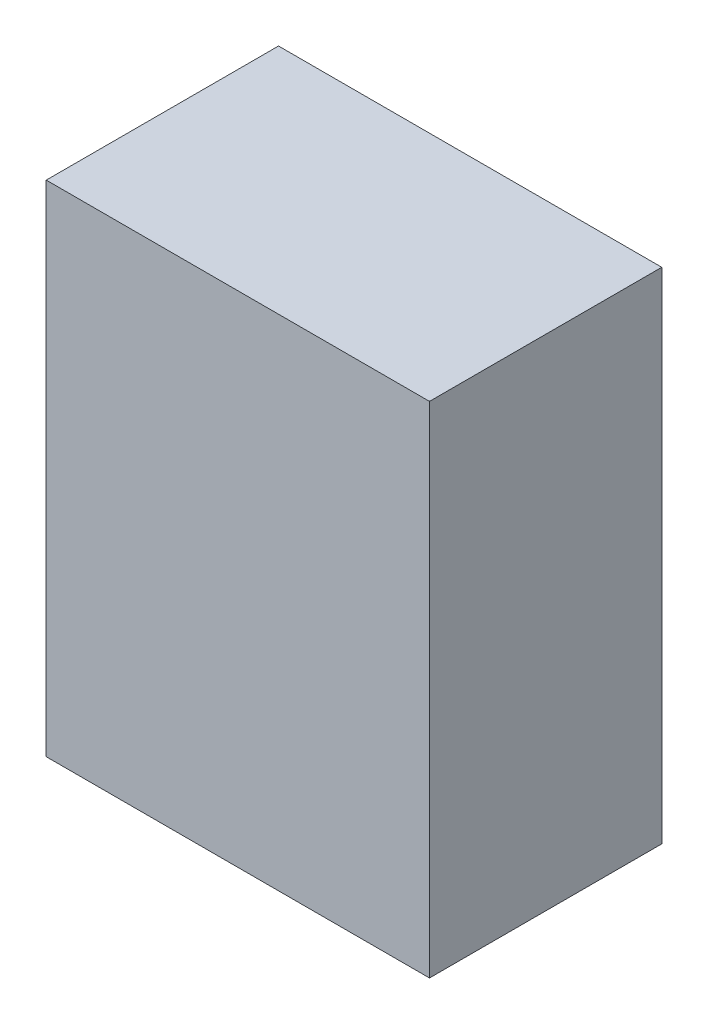
ISO-10303-21;
HEADER;
FILE_DESCRIPTION(('STEP AP214'),'2;1');
FILE_NAME('part.step','',(''),(''),'','','');
FILE_SCHEMA(('AUTOMOTIVE_DESIGN { 1 0 10303 214 1 1 1 1 }'));
ENDSEC;
DATA;
#1=APPLICATION_CONTEXT('core data for automotive mechanical design processes');
#2=APPLICATION_PROTOCOL_DEFINITION('international standard','automotive_design',2000,#1);
#3=PRODUCT_CONTEXT('',#1,'mechanical');
#4=PRODUCT('Part','Part','',(#3));
#5=PRODUCT_RELATED_PRODUCT_CATEGORY('part','',(#4));
#6=PRODUCT_DEFINITION_FORMATION('','',#4);
#7=PRODUCT_DEFINITION_CONTEXT('part definition',#1,'design');
#8=PRODUCT_DEFINITION('design','',#6,#7);
#9=PRODUCT_DEFINITION_SHAPE('','',#8);
#10=(LENGTH_UNIT() NAMED_UNIT(*) SI_UNIT(.MILLI.,.METRE.));
#11=(NAMED_UNIT(*) PLANE_ANGLE_UNIT() SI_UNIT($,.RADIAN.));
#12=(NAMED_UNIT(*) SI_UNIT($,.STERADIAN.) SOLID_ANGLE_UNIT());
#13=UNCERTAINTY_MEASURE_WITH_UNIT(LENGTH_MEASURE(1.E-05),#10,'distance_accuracy_value','');
#14=(GEOMETRIC_REPRESENTATION_CONTEXT(3) GLOBAL_UNCERTAINTY_ASSIGNED_CONTEXT((#13)) GLOBAL_UNIT_ASSIGNED_CONTEXT((#10,
#11,#12)) REPRESENTATION_CONTEXT('',''));
#15=CARTESIAN_POINT('',(0.,0.,0.));
#16=DIRECTION('',(0.,0.,1.));
#17=DIRECTION('',(1.,0.,0.));
#18=AXIS2_PLACEMENT_3D('',#15,#16,#17);
#19=CARTESIAN_POINT('',(-0.82499962,1.07500166,1.00000054));
#20=DIRECTION('',(0.,0.,-1.));
#21=DIRECTION('',(-1.,0.,0.));
#22=AXIS2_PLACEMENT_3D('',#19,#20,#21);
#23=PLANE('',#22);
#24=DIRECTION('',(1.,0.,0.));
#25=VECTOR('',#24,1.);
#26=CARTESIAN_POINT('',(-0.82499962,-1.07499912,1.00000054));
#27=LINE('',#26,#25);
#28=CARTESIAN_POINT('',(-0.82499962,-1.07499912,1.00000054));
#29=VERTEX_POINT('',#28);
#30=CARTESIAN_POINT('',(0.82499962,-1.07499912,1.00000054));
#31=VERTEX_POINT('',#30);
#32=EDGE_CURVE('E55',#29,#31,#27,.T.);
#33=ORIENTED_EDGE('',*,*,#32,.T.);
#34=DIRECTION('',(0.,1.,0.));
#35=VECTOR('',#34,1.);
#36=CARTESIAN_POINT('',(0.82499962,-1.07499912,1.00000054));
#37=LINE('',#36,#35);
#38=CARTESIAN_POINT('',(0.82499962,1.07500166,1.00000054));
#39=VERTEX_POINT('',#38);
#40=EDGE_CURVE('E57',#31,#39,#37,.T.);
#41=ORIENTED_EDGE('',*,*,#40,.T.);
#42=DIRECTION('',(1.,0.,0.));
#43=VECTOR('',#42,1.);
#44=CARTESIAN_POINT('',(0.82499962,1.07500166,1.00000054));
#45=LINE('',#44,#43);
#46=CARTESIAN_POINT('',(-0.82499962,1.07500166,1.00000054));
#47=VERTEX_POINT('',#46);
#48=EDGE_CURVE('E20',#39,#47,#45,.F.);
#49=ORIENTED_EDGE('',*,*,#48,.T.);
#50=DIRECTION('',(0.,1.,0.));
#51=VECTOR('',#50,1.);
#52=CARTESIAN_POINT('',(-0.82499962,1.07500166,1.00000054));
#53=LINE('',#52,#51);
#54=EDGE_CURVE('E80',#47,#29,#53,.F.);
#55=ORIENTED_EDGE('',*,*,#54,.T.);
#56=EDGE_LOOP('',(#33,#41,#49,#55));
#57=FACE_BOUND('',#56,.T.);
#58=ADVANCED_FACE('F17',(#57),#23,.F.);
#59=CARTESIAN_POINT('',(0.82499962,1.07500166,0.));
#60=DIRECTION('',(0.,-1.,0.));
#61=DIRECTION('',(0.,0.,-1.));
#62=AXIS2_PLACEMENT_3D('',#59,#60,#61);
#63=PLANE('',#62);
#64=DIRECTION('',(0.,0.,-1.));
#65=VECTOR('',#64,1.);
#66=CARTESIAN_POINT('',(-0.82499962,1.07500166,0.));
#67=LINE('',#66,#65);
#68=CARTESIAN_POINT('',(-0.82499962,1.07500166,0.));
#69=VERTEX_POINT('',#68);
#70=EDGE_CURVE('E68',#69,#47,#67,.F.);
#71=ORIENTED_EDGE('',*,*,#70,.T.);
#72=ORIENTED_EDGE('',*,*,#48,.F.);
#73=DIRECTION('',(0.,0.,1.));
#74=VECTOR('',#73,1.);
#75=CARTESIAN_POINT('',(0.82499962,1.07500166,0.));
#76=LINE('',#75,#74);
#77=CARTESIAN_POINT('',(0.82499962,1.07500166,0.));
#78=VERTEX_POINT('',#77);
#79=EDGE_CURVE('E63',#39,#78,#76,.F.);
#80=ORIENTED_EDGE('',*,*,#79,.T.);
#81=DIRECTION('',(-1.,0.,0.));
#82=VECTOR('',#81,1.);
#83=CARTESIAN_POINT('',(-0.82499962,1.07500166,0.));
#84=LINE('',#83,#82);
#85=EDGE_CURVE('E83',#69,#78,#84,.F.);
#86=ORIENTED_EDGE('',*,*,#85,.F.);
#87=EDGE_LOOP('',(#71,#72,#80,#86));
#88=FACE_BOUND('',#87,.T.);
#89=ADVANCED_FACE('F65',(#88),#63,.F.);
#90=CARTESIAN_POINT('',(0.82499962,-1.07499912,0.));
#91=DIRECTION('',(-1.,0.,0.));
#92=DIRECTION('',(0.,0.,1.));
#93=AXIS2_PLACEMENT_3D('',#90,#91,#92);
#94=PLANE('',#93);
#95=ORIENTED_EDGE('',*,*,#79,.F.);
#96=ORIENTED_EDGE('',*,*,#40,.F.);
#97=DIRECTION('',(0.,0.,1.));
#98=VECTOR('',#97,1.);
#99=CARTESIAN_POINT('',(0.82499962,-1.07499912,0.));
#100=LINE('',#99,#98);
#101=CARTESIAN_POINT('',(0.82499962,-1.07499912,0.));
#102=VERTEX_POINT('',#101);
#103=EDGE_CURVE('E75',#31,#102,#100,.F.);
#104=ORIENTED_EDGE('',*,*,#103,.T.);
#105=DIRECTION('',(0.,1.,0.));
#106=VECTOR('',#105,1.);
#107=CARTESIAN_POINT('',(0.82499962,1.07500166,0.));
#108=LINE('',#107,#106);
#109=EDGE_CURVE('E72',#78,#102,#108,.F.);
#110=ORIENTED_EDGE('',*,*,#109,.F.);
#111=EDGE_LOOP('',(#95,#96,#104,#110));
#112=FACE_BOUND('',#111,.T.);
#113=ADVANCED_FACE('F70',(#112),#94,.F.);
#114=CARTESIAN_POINT('',(-0.82499962,-1.07499912,0.));
#115=DIRECTION('',(0.,1.,0.));
#116=DIRECTION('',(0.,0.,1.));
#117=AXIS2_PLACEMENT_3D('',#114,#115,#116);
#118=PLANE('',#117);
#119=ORIENTED_EDGE('',*,*,#103,.F.);
#120=ORIENTED_EDGE('',*,*,#32,.F.);
#121=DIRECTION('',(0.,0.,-1.));
#122=VECTOR('',#121,1.);
#123=CARTESIAN_POINT('',(-0.82499962,-1.07499912,0.));
#124=LINE('',#123,#122);
#125=CARTESIAN_POINT('',(-0.82499962,-1.07499912,0.));
#126=VERTEX_POINT('',#125);
#127=EDGE_CURVE('E35',#29,#126,#124,.T.);
#128=ORIENTED_EDGE('',*,*,#127,.T.);
#129=DIRECTION('',(-1.,0.,0.));
#130=VECTOR('',#129,1.);
#131=CARTESIAN_POINT('',(-0.82499962,-1.07499912,0.));
#132=LINE('',#131,#130);
#133=EDGE_CURVE('E26',#102,#126,#132,.T.);
#134=ORIENTED_EDGE('',*,*,#133,.F.);
#135=EDGE_LOOP('',(#119,#120,#128,#134));
#136=FACE_BOUND('',#135,.T.);
#137=ADVANCED_FACE('F89',(#136),#118,.F.);
#138=CARTESIAN_POINT('',(-0.82499962,1.07500166,0.));
#139=DIRECTION('',(1.,0.,0.));
#140=DIRECTION('',(0.,0.,-1.));
#141=AXIS2_PLACEMENT_3D('',#138,#139,#140);
#142=PLANE('',#141);
#143=ORIENTED_EDGE('',*,*,#127,.F.);
#144=ORIENTED_EDGE('',*,*,#54,.F.);
#145=ORIENTED_EDGE('',*,*,#70,.F.);
#146=DIRECTION('',(0.,1.,0.));
#147=VECTOR('',#146,1.);
#148=CARTESIAN_POINT('',(-0.82499962,1.07500166,0.));
#149=LINE('',#148,#147);
#150=EDGE_CURVE('E11',#126,#69,#149,.T.);
#151=ORIENTED_EDGE('',*,*,#150,.F.);
#152=EDGE_LOOP('',(#143,#144,#145,#151));
#153=FACE_BOUND('',#152,.T.);
#154=ADVANCED_FACE('F91',(#153),#142,.F.);
#155=CARTESIAN_POINT('',(-0.82499962,1.07500166,0.));
#156=DIRECTION('',(0.,0.,-1.));
#157=DIRECTION('',(-1.,0.,0.));
#158=AXIS2_PLACEMENT_3D('',#155,#156,#157);
#159=PLANE('',#158);
#160=ORIENTED_EDGE('',*,*,#133,.T.);
#161=ORIENTED_EDGE('',*,*,#150,.T.);
#162=ORIENTED_EDGE('',*,*,#85,.T.);
#163=ORIENTED_EDGE('',*,*,#109,.T.);
#164=EDGE_LOOP('',(#160,#161,#162,#163));
#165=FACE_BOUND('',#164,.T.);
#166=ADVANCED_FACE('F88',(#165),#159,.T.);
#167=CLOSED_SHELL('',(#58,#89,#113,#137,#154,#166));
#168=MANIFOLD_SOLID_BREP('B1',#167);
#169=ADVANCED_BREP_SHAPE_REPRESENTATION('',(#18,#168),#14);
#170=SHAPE_DEFINITION_REPRESENTATION(#9,#169);
ENDSEC;
END-ISO-10303-21;
